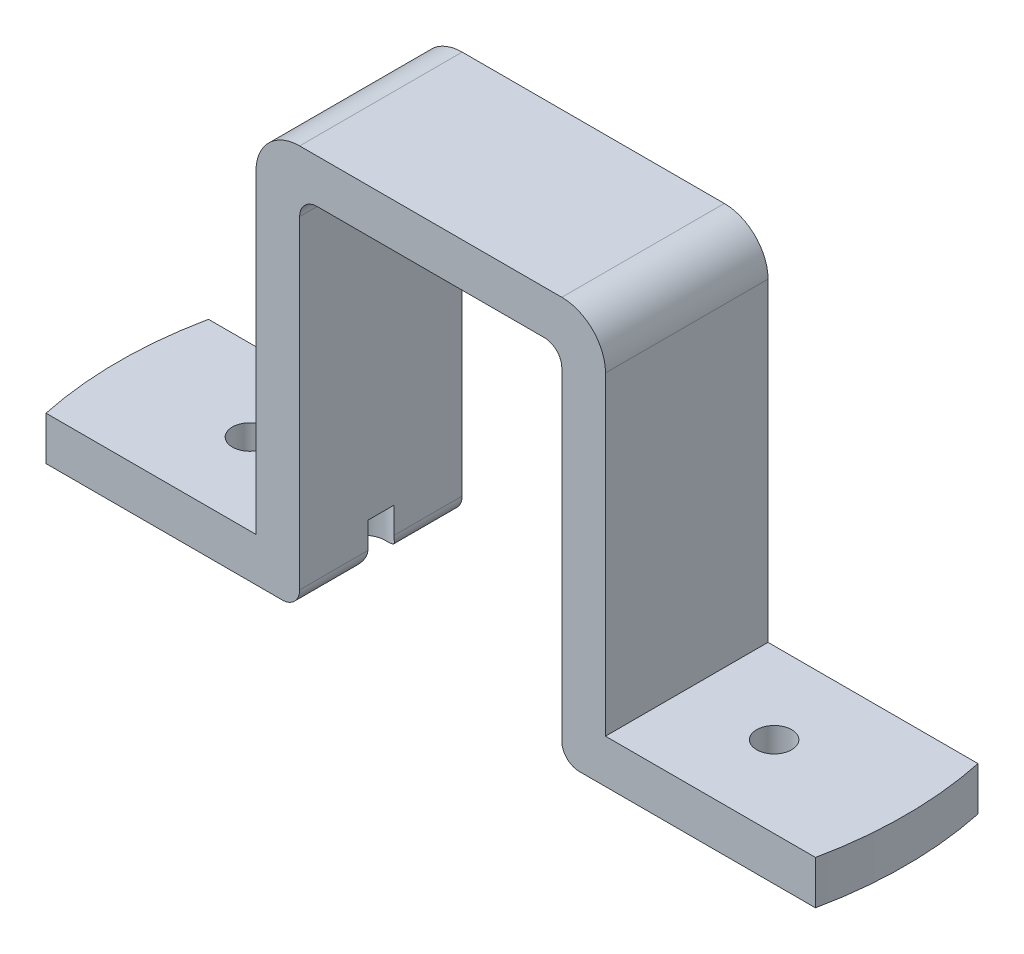
ISO-10303-21;
HEADER;
FILE_DESCRIPTION(('STEP AP214'),'2;1');
FILE_NAME('part.step','',(''),(''),'','','');
FILE_SCHEMA(('AUTOMOTIVE_DESIGN { 1 0 10303 214 1 1 1 1 }'));
ENDSEC;
DATA;
#1=APPLICATION_CONTEXT('core data for automotive mechanical design processes');
#2=APPLICATION_PROTOCOL_DEFINITION('international standard','automotive_design',2000,#1);
#3=PRODUCT_CONTEXT('',#1,'mechanical');
#4=PRODUCT('Part','Part','',(#3));
#5=PRODUCT_RELATED_PRODUCT_CATEGORY('part','',(#4));
#6=PRODUCT_DEFINITION_FORMATION('','',#4);
#7=PRODUCT_DEFINITION_CONTEXT('part definition',#1,'design');
#8=PRODUCT_DEFINITION('design','',#6,#7);
#9=PRODUCT_DEFINITION_SHAPE('','',#8);
#10=(LENGTH_UNIT() NAMED_UNIT(*) SI_UNIT(.MILLI.,.METRE.));
#11=(NAMED_UNIT(*) PLANE_ANGLE_UNIT() SI_UNIT($,.RADIAN.));
#12=(NAMED_UNIT(*) SI_UNIT($,.STERADIAN.) SOLID_ANGLE_UNIT());
#13=UNCERTAINTY_MEASURE_WITH_UNIT(LENGTH_MEASURE(1.E-05),#10,'distance_accuracy_value','');
#14=(GEOMETRIC_REPRESENTATION_CONTEXT(3) GLOBAL_UNCERTAINTY_ASSIGNED_CONTEXT((#13)) GLOBAL_UNIT_ASSIGNED_CONTEXT((#10,
#11,#12)) REPRESENTATION_CONTEXT('',''));
#15=CARTESIAN_POINT('',(0.,0.,0.));
#16=DIRECTION('',(0.,0.,1.));
#17=DIRECTION('',(1.,0.,0.));
#18=AXIS2_PLACEMENT_3D('',#15,#16,#17);
#19=CARTESIAN_POINT('',(0.,5.,18.6));
#20=DIRECTION('',(0.,1.,0.));
#21=DIRECTION('',(0.,0.,1.));
#22=AXIS2_PLACEMENT_3D('',#19,#20,#21);
#23=PLANE('',#22);
#24=CARTESIAN_POINT('',(75.,5.,9.3));
#25=DIRECTION('',(0.,1.,0.));
#26=DIRECTION('',(0.,0.,1.));
#27=AXIS2_PLACEMENT_3D('',#24,#25,#26);
#28=CIRCLE('',#27,2.);
#29=CARTESIAN_POINT('',(75.,5.,11.3));
#30=VERTEX_POINT('',#29);
#31=EDGE_CURVE('E252',#30,#30,#28,.T.);
#32=ORIENTED_EDGE('',*,*,#31,.F.);
#33=EDGE_LOOP('',(#32));
#34=FACE_BOUND('',#33,.T.);
#35=DIRECTION('',(1.,0.,0.));
#36=VECTOR('',#35,1.);
#37=CARTESIAN_POINT('',(0.,5.,18.6));
#38=LINE('',#37,#36);
#39=CARTESIAN_POINT('',(65.,5.,18.6));
#40=VERTEX_POINT('',#39);
#41=CARTESIAN_POINT('',(89.0285134884202,5.,18.6));
#42=VERTEX_POINT('',#41);
#43=EDGE_CURVE('E239',#40,#42,#38,.T.);
#44=ORIENTED_EDGE('',*,*,#43,.T.);
#45=CARTESIAN_POINT('',(45.,5.,9.3));
#46=DIRECTION('',(0.,1.,0.));
#47=DIRECTION('',(0.,0.,1.));
#48=AXIS2_PLACEMENT_3D('',#45,#46,#47);
#49=CIRCLE('',#48,45.);
#50=CARTESIAN_POINT('',(89.0285134884202,5.,0.));
#51=VERTEX_POINT('',#50);
#52=EDGE_CURVE('E469',#42,#51,#49,.T.);
#53=ORIENTED_EDGE('',*,*,#52,.T.);
#54=DIRECTION('',(1.,0.,0.));
#55=VECTOR('',#54,1.);
#56=CARTESIAN_POINT('',(0.,5.,0.));
#57=LINE('',#56,#55);
#58=CARTESIAN_POINT('',(65.,5.,0.));
#59=VERTEX_POINT('',#58);
#60=EDGE_CURVE('E251',#59,#51,#57,.T.);
#61=ORIENTED_EDGE('',*,*,#60,.F.);
#62=DIRECTION('',(0.,0.,-1.));
#63=VECTOR('',#62,1.);
#64=CARTESIAN_POINT('',(65.,5.,18.6));
#65=LINE('',#64,#63);
#66=EDGE_CURVE('E243',#40,#59,#65,.T.);
#67=ORIENTED_EDGE('',*,*,#66,.F.);
#68=EDGE_LOOP('',(#44,#53,#61,#67));
#69=FACE_BOUND('',#68,.T.);
#70=ADVANCED_FACE('F35',(#34,#69),#23,.T.);
#71=CARTESIAN_POINT('',(0.,5.,18.6));
#72=DIRECTION('',(0.,1.,0.));
#73=DIRECTION('',(0.,0.,1.));
#74=AXIS2_PLACEMENT_3D('',#71,#72,#73);
#75=PLANE('',#74);
#76=CARTESIAN_POINT('',(15.,5.,9.3));
#77=DIRECTION('',(0.,1.,0.));
#78=DIRECTION('',(0.,0.,1.));
#79=AXIS2_PLACEMENT_3D('',#76,#77,#78);
#80=CIRCLE('',#79,2.00000000000001);
#81=CARTESIAN_POINT('',(15.,5.,11.3));
#82=VERTEX_POINT('',#81);
#83=EDGE_CURVE('E475',#82,#82,#80,.T.);
#84=ORIENTED_EDGE('',*,*,#83,.F.);
#85=EDGE_LOOP('',(#84));
#86=FACE_BOUND('',#85,.T.);
#87=DIRECTION('',(1.,0.,0.));
#88=VECTOR('',#87,1.);
#89=CARTESIAN_POINT('',(0.,5.,0.));
#90=LINE('',#89,#88);
#91=CARTESIAN_POINT('',(0.971486511579786,5.,0.));
#92=VERTEX_POINT('',#91);
#93=CARTESIAN_POINT('',(25.,5.,0.));
#94=VERTEX_POINT('',#93);
#95=EDGE_CURVE('E225',#92,#94,#90,.T.);
#96=ORIENTED_EDGE('',*,*,#95,.F.);
#97=CARTESIAN_POINT('',(45.,5.,9.3));
#98=DIRECTION('',(0.,1.,0.));
#99=DIRECTION('',(0.,0.,1.));
#100=AXIS2_PLACEMENT_3D('',#97,#98,#99);
#101=CIRCLE('',#100,45.);
#102=CARTESIAN_POINT('',(0.971486511579786,5.,18.6));
#103=VERTEX_POINT('',#102);
#104=EDGE_CURVE('E205',#92,#103,#101,.T.);
#105=ORIENTED_EDGE('',*,*,#104,.T.);
#106=DIRECTION('',(1.,0.,0.));
#107=VECTOR('',#106,1.);
#108=CARTESIAN_POINT('',(0.,5.,18.6));
#109=LINE('',#108,#107);
#110=CARTESIAN_POINT('',(25.,5.,18.6));
#111=VERTEX_POINT('',#110);
#112=EDGE_CURVE('E433',#103,#111,#109,.T.);
#113=ORIENTED_EDGE('',*,*,#112,.T.);
#114=DIRECTION('',(0.,0.,-1.));
#115=VECTOR('',#114,1.);
#116=CARTESIAN_POINT('',(25.,5.,18.6));
#117=LINE('',#116,#115);
#118=EDGE_CURVE('E240',#111,#94,#117,.T.);
#119=ORIENTED_EDGE('',*,*,#118,.T.);
#120=EDGE_LOOP('',(#96,#105,#113,#119));
#121=FACE_BOUND('',#120,.T.);
#122=ADVANCED_FACE('F388',(#86,#121),#75,.T.);
#123=CARTESIAN_POINT('',(0.,0.,18.6));
#124=DIRECTION('',(0.,1.,0.));
#125=DIRECTION('',(0.,0.,1.));
#126=AXIS2_PLACEMENT_3D('',#123,#124,#125);
#127=PLANE('',#126);
#128=CARTESIAN_POINT('',(15.,0.,9.3));
#129=DIRECTION('',(0.,1.,0.));
#130=DIRECTION('',(0.,0.,1.));
#131=AXIS2_PLACEMENT_3D('',#128,#129,#130);
#132=CIRCLE('',#131,2.00000000000001);
#133=CARTESIAN_POINT('',(15.,0.,11.3));
#134=VERTEX_POINT('',#133);
#135=EDGE_CURVE('E264',#134,#134,#132,.T.);
#136=ORIENTED_EDGE('',*,*,#135,.T.);
#137=EDGE_LOOP('',(#136));
#138=FACE_BOUND('',#137,.T.);
#139=DIRECTION('',(1.,0.,0.));
#140=VECTOR('',#139,1.);
#141=CARTESIAN_POINT('',(0.,0.,0.));
#142=LINE('',#141,#140);
#143=CARTESIAN_POINT('',(0.971486511579786,0.,0.));
#144=VERTEX_POINT('',#143);
#145=CARTESIAN_POINT('',(28.,0.,0.));
#146=VERTEX_POINT('',#145);
#147=EDGE_CURVE('E216',#144,#146,#142,.T.);
#148=ORIENTED_EDGE('',*,*,#147,.T.);
#149=DIRECTION('',(0.,0.,-1.));
#150=VECTOR('',#149,1.);
#151=CARTESIAN_POINT('',(28.,0.,18.6));
#152=LINE('',#151,#150);
#153=CARTESIAN_POINT('',(28.,0.,6.8));
#154=VERTEX_POINT('',#153);
#155=EDGE_CURVE('E326',#146,#154,#152,.F.);
#156=ORIENTED_EDGE('',*,*,#155,.T.);
#157=CARTESIAN_POINT('',(28.,0.,9.3));
#158=DIRECTION('',(0.,1.,0.));
#159=DIRECTION('',(0.,0.,1.));
#160=AXIS2_PLACEMENT_3D('',#157,#158,#159);
#161=CIRCLE('',#160,2.5);
#162=CARTESIAN_POINT('',(28.,0.,11.8));
#163=VERTEX_POINT('',#162);
#164=EDGE_CURVE('E266',#154,#163,#161,.T.);
#165=ORIENTED_EDGE('',*,*,#164,.T.);
#166=DIRECTION('',(0.,0.,-1.));
#167=VECTOR('',#166,1.);
#168=CARTESIAN_POINT('',(28.,0.,18.6));
#169=LINE('',#168,#167);
#170=CARTESIAN_POINT('',(28.,0.,18.6));
#171=VERTEX_POINT('',#170);
#172=EDGE_CURVE('E301',#163,#171,#169,.F.);
#173=ORIENTED_EDGE('',*,*,#172,.T.);
#174=DIRECTION('',(1.,0.,0.));
#175=VECTOR('',#174,1.);
#176=CARTESIAN_POINT('',(0.,0.,18.6));
#177=LINE('',#176,#175);
#178=CARTESIAN_POINT('',(0.971486511579786,0.,18.6));
#179=VERTEX_POINT('',#178);
#180=EDGE_CURVE('E219',#179,#171,#177,.T.);
#181=ORIENTED_EDGE('',*,*,#180,.F.);
#182=CARTESIAN_POINT('',(45.,0.,9.3));
#183=DIRECTION('',(0.,1.,0.));
#184=DIRECTION('',(0.,0.,1.));
#185=AXIS2_PLACEMENT_3D('',#182,#183,#184);
#186=CIRCLE('',#185,45.);
#187=EDGE_CURVE('E202',#144,#179,#186,.T.);
#188=ORIENTED_EDGE('',*,*,#187,.F.);
#189=EDGE_LOOP('',(#148,#156,#165,#173,#181,#188));
#190=FACE_BOUND('',#189,.T.);
#191=ADVANCED_FACE('F215',(#138,#190),#127,.F.);
#192=CARTESIAN_POINT('',(0.,0.,18.6));
#193=DIRECTION('',(0.,1.,0.));
#194=DIRECTION('',(0.,0.,1.));
#195=AXIS2_PLACEMENT_3D('',#192,#193,#194);
#196=PLANE('',#195);
#197=CARTESIAN_POINT('',(75.,0.,9.3));
#198=DIRECTION('',(0.,1.,0.));
#199=DIRECTION('',(0.,0.,1.));
#200=AXIS2_PLACEMENT_3D('',#197,#198,#199);
#201=CIRCLE('',#200,2.);
#202=CARTESIAN_POINT('',(75.,0.,11.3));
#203=VERTEX_POINT('',#202);
#204=EDGE_CURVE('E248',#203,#203,#201,.T.);
#205=ORIENTED_EDGE('',*,*,#204,.T.);
#206=EDGE_LOOP('',(#205));
#207=FACE_BOUND('',#206,.T.);
#208=CARTESIAN_POINT('',(62.,0.,9.3));
#209=DIRECTION('',(0.,1.,0.));
#210=DIRECTION('',(0.,0.,1.));
#211=AXIS2_PLACEMENT_3D('',#208,#209,#210);
#212=CIRCLE('',#211,2.5);
#213=CARTESIAN_POINT('',(62.,0.,11.8));
#214=VERTEX_POINT('',#213);
#215=CARTESIAN_POINT('',(62.,0.,6.80000000000001));
#216=VERTEX_POINT('',#215);
#217=EDGE_CURVE('E247',#214,#216,#212,.T.);
#218=ORIENTED_EDGE('',*,*,#217,.T.);
#219=DIRECTION('',(0.,0.,-1.));
#220=VECTOR('',#219,1.);
#221=CARTESIAN_POINT('',(62.,0.,18.6));
#222=LINE('',#221,#220);
#223=CARTESIAN_POINT('',(62.,0.,0.));
#224=VERTEX_POINT('',#223);
#225=EDGE_CURVE('E325',#216,#224,#222,.T.);
#226=ORIENTED_EDGE('',*,*,#225,.T.);
#227=DIRECTION('',(1.,0.,0.));
#228=VECTOR('',#227,1.);
#229=CARTESIAN_POINT('',(0.,0.,0.));
#230=LINE('',#229,#228);
#231=CARTESIAN_POINT('',(89.0285134884202,0.,0.));
#232=VERTEX_POINT('',#231);
#233=EDGE_CURVE('E237',#224,#232,#230,.T.);
#234=ORIENTED_EDGE('',*,*,#233,.T.);
#235=CARTESIAN_POINT('',(45.,0.,9.3));
#236=DIRECTION('',(0.,1.,0.));
#237=DIRECTION('',(0.,0.,1.));
#238=AXIS2_PLACEMENT_3D('',#235,#236,#237);
#239=CIRCLE('',#238,45.);
#240=CARTESIAN_POINT('',(89.0285134884202,0.,18.6));
#241=VERTEX_POINT('',#240);
#242=EDGE_CURVE('E464',#241,#232,#239,.T.);
#243=ORIENTED_EDGE('',*,*,#242,.F.);
#244=DIRECTION('',(1.,0.,0.));
#245=VECTOR('',#244,1.);
#246=CARTESIAN_POINT('',(0.,0.,18.6));
#247=LINE('',#246,#245);
#248=CARTESIAN_POINT('',(62.,0.,18.6));
#249=VERTEX_POINT('',#248);
#250=EDGE_CURVE('E244',#249,#241,#247,.T.);
#251=ORIENTED_EDGE('',*,*,#250,.F.);
#252=DIRECTION('',(0.,0.,-1.));
#253=VECTOR('',#252,1.);
#254=CARTESIAN_POINT('',(62.,0.,18.6));
#255=LINE('',#254,#253);
#256=EDGE_CURVE('E352',#249,#214,#255,.T.);
#257=ORIENTED_EDGE('',*,*,#256,.T.);
#258=EDGE_LOOP('',(#218,#226,#234,#243,#251,#257));
#259=FACE_BOUND('',#258,.T.);
#260=ADVANCED_FACE('F367',(#207,#259),#196,.F.);
#261=CARTESIAN_POINT('',(0.,0.,18.6));
#262=DIRECTION('',(0.,0.,1.));
#263=DIRECTION('',(1.,0.,0.));
#264=AXIS2_PLACEMENT_3D('',#261,#262,#263);
#265=PLANE('',#264);
#266=ORIENTED_EDGE('',*,*,#180,.T.);
#267=CARTESIAN_POINT('',(28.,2.,18.6));
#268=DIRECTION('',(0.,0.,1.));
#269=DIRECTION('',(1.,0.,0.));
#270=AXIS2_PLACEMENT_3D('',#267,#268,#269);
#271=CIRCLE('',#270,2.);
#272=CARTESIAN_POINT('',(30.,2.,18.6));
#273=VERTEX_POINT('',#272);
#274=EDGE_CURVE('E717',#171,#273,#271,.T.);
#275=ORIENTED_EDGE('',*,*,#274,.T.);
#276=DIRECTION('',(0.,1.,0.));
#277=VECTOR('',#276,1.);
#278=CARTESIAN_POINT('',(30.,0.,18.6));
#279=LINE('',#278,#277);
#280=CARTESIAN_POINT('',(30.,39.,18.6));
#281=VERTEX_POINT('',#280);
#282=EDGE_CURVE('E440',#273,#281,#279,.T.);
#283=ORIENTED_EDGE('',*,*,#282,.T.);
#284=CARTESIAN_POINT('',(32.,39.,18.6));
#285=DIRECTION('',(0.,0.,1.));
#286=DIRECTION('',(1.,0.,0.));
#287=AXIS2_PLACEMENT_3D('',#284,#285,#286);
#288=CIRCLE('',#287,2.);
#289=CARTESIAN_POINT('',(32.,41.,18.6));
#290=VERTEX_POINT('',#289);
#291=EDGE_CURVE('E700',#281,#290,#288,.F.);
#292=ORIENTED_EDGE('',*,*,#291,.T.);
#293=DIRECTION('',(1.,0.,0.));
#294=VECTOR('',#293,1.);
#295=CARTESIAN_POINT('',(0.,41.,18.6));
#296=LINE('',#295,#294);
#297=CARTESIAN_POINT('',(58.,41.,18.6));
#298=VERTEX_POINT('',#297);
#299=EDGE_CURVE('E443',#290,#298,#296,.T.);
#300=ORIENTED_EDGE('',*,*,#299,.T.);
#301=CARTESIAN_POINT('',(58.,39.,18.6));
#302=DIRECTION('',(0.,0.,1.));
#303=DIRECTION('',(1.,0.,0.));
#304=AXIS2_PLACEMENT_3D('',#301,#302,#303);
#305=CIRCLE('',#304,2.);
#306=CARTESIAN_POINT('',(60.,39.,18.6));
#307=VERTEX_POINT('',#306);
#308=EDGE_CURVE('E695',#298,#307,#305,.F.);
#309=ORIENTED_EDGE('',*,*,#308,.T.);
#310=DIRECTION('',(0.,-1.,0.));
#311=VECTOR('',#310,1.);
#312=CARTESIAN_POINT('',(60.,0.,18.6));
#313=LINE('',#312,#311);
#314=CARTESIAN_POINT('',(60.,2.,18.6));
#315=VERTEX_POINT('',#314);
#316=EDGE_CURVE('E446',#307,#315,#313,.T.);
#317=ORIENTED_EDGE('',*,*,#316,.T.);
#318=CARTESIAN_POINT('',(62.,2.,18.6));
#319=DIRECTION('',(0.,0.,1.));
#320=DIRECTION('',(1.,0.,0.));
#321=AXIS2_PLACEMENT_3D('',#318,#319,#320);
#322=CIRCLE('',#321,2.);
#323=EDGE_CURVE('E686',#315,#249,#322,.T.);
#324=ORIENTED_EDGE('',*,*,#323,.T.);
#325=ORIENTED_EDGE('',*,*,#250,.T.);
#326=DIRECTION('',(0.,1.,0.));
#327=VECTOR('',#326,1.);
#328=CARTESIAN_POINT('',(89.0285134884202,-14.,18.6));
#329=LINE('',#328,#327);
#330=EDGE_CURVE('E471',#241,#42,#329,.T.);
#331=ORIENTED_EDGE('',*,*,#330,.T.);
#332=ORIENTED_EDGE('',*,*,#43,.F.);
#333=DIRECTION('',(0.,-1.,0.));
#334=VECTOR('',#333,1.);
#335=CARTESIAN_POINT('',(65.,0.,18.6));
#336=LINE('',#335,#334);
#337=CARTESIAN_POINT('',(65.,41.,18.6));
#338=VERTEX_POINT('',#337);
#339=EDGE_CURVE('E426',#338,#40,#336,.T.);
#340=ORIENTED_EDGE('',*,*,#339,.F.);
#341=CARTESIAN_POINT('',(60.,41.,18.6));
#342=DIRECTION('',(0.,0.,1.));
#343=DIRECTION('',(1.,0.,0.));
#344=AXIS2_PLACEMENT_3D('',#341,#342,#343);
#345=CIRCLE('',#344,5.);
#346=CARTESIAN_POINT('',(60.,46.,18.6));
#347=VERTEX_POINT('',#346);
#348=EDGE_CURVE('E286',#338,#347,#345,.T.);
#349=ORIENTED_EDGE('',*,*,#348,.T.);
#350=DIRECTION('',(1.,0.,0.));
#351=VECTOR('',#350,1.);
#352=CARTESIAN_POINT('',(0.,46.,18.6));
#353=LINE('',#352,#351);
#354=CARTESIAN_POINT('',(30.,46.,18.6));
#355=VERTEX_POINT('',#354);
#356=EDGE_CURVE('E423',#355,#347,#353,.T.);
#357=ORIENTED_EDGE('',*,*,#356,.F.);
#358=CARTESIAN_POINT('',(30.,41.,18.6));
#359=DIRECTION('',(0.,0.,1.));
#360=DIRECTION('',(1.,0.,0.));
#361=AXIS2_PLACEMENT_3D('',#358,#359,#360);
#362=CIRCLE('',#361,5.);
#363=CARTESIAN_POINT('',(25.,41.,18.6));
#364=VERTEX_POINT('',#363);
#365=EDGE_CURVE('E277',#355,#364,#362,.T.);
#366=ORIENTED_EDGE('',*,*,#365,.T.);
#367=DIRECTION('',(0.,1.,0.));
#368=VECTOR('',#367,1.);
#369=CARTESIAN_POINT('',(25.,0.,18.6));
#370=LINE('',#369,#368);
#371=EDGE_CURVE('E430',#111,#364,#370,.T.);
#372=ORIENTED_EDGE('',*,*,#371,.F.);
#373=ORIENTED_EDGE('',*,*,#112,.F.);
#374=DIRECTION('',(0.,1.,0.));
#375=VECTOR('',#374,1.);
#376=CARTESIAN_POINT('',(0.971486511579786,-14.,18.6));
#377=LINE('',#376,#375);
#378=EDGE_CURVE('E461',#103,#179,#377,.F.);
#379=ORIENTED_EDGE('',*,*,#378,.T.);
#380=EDGE_LOOP('',(#266,#275,#283,#292,#300,#309,#317,#324,#325,#331,#332,#340,#349,#357,#366,
#372,#373,#379));
#381=FACE_BOUND('',#380,.T.);
#382=ADVANCED_FACE('F364',(#381),#265,.T.);
#383=CARTESIAN_POINT('',(0.,0.,0.));
#384=DIRECTION('',(0.,0.,1.));
#385=DIRECTION('',(1.,0.,0.));
#386=AXIS2_PLACEMENT_3D('',#383,#384,#385);
#387=PLANE('',#386);
#388=DIRECTION('',(0.,1.,0.));
#389=VECTOR('',#388,1.);
#390=CARTESIAN_POINT('',(30.,0.,0.));
#391=LINE('',#390,#389);
#392=CARTESIAN_POINT('',(30.,2.,0.));
#393=VERTEX_POINT('',#392);
#394=CARTESIAN_POINT('',(30.,39.,0.));
#395=VERTEX_POINT('',#394);
#396=EDGE_CURVE('E224',#393,#395,#391,.T.);
#397=ORIENTED_EDGE('',*,*,#396,.F.);
#398=CARTESIAN_POINT('',(28.,2.,0.));
#399=DIRECTION('',(0.,0.,1.));
#400=DIRECTION('',(1.,0.,0.));
#401=AXIS2_PLACEMENT_3D('',#398,#399,#400);
#402=CIRCLE('',#401,2.);
#403=EDGE_CURVE('E223',#393,#146,#402,.F.);
#404=ORIENTED_EDGE('',*,*,#403,.T.);
#405=ORIENTED_EDGE('',*,*,#147,.F.);
#406=DIRECTION('',(0.,1.,0.));
#407=VECTOR('',#406,1.);
#408=CARTESIAN_POINT('',(0.971486511579786,-14.,0.));
#409=LINE('',#408,#407);
#410=EDGE_CURVE('E199',#92,#144,#409,.F.);
#411=ORIENTED_EDGE('',*,*,#410,.F.);
#412=ORIENTED_EDGE('',*,*,#95,.T.);
#413=DIRECTION('',(0.,1.,0.));
#414=VECTOR('',#413,1.);
#415=CARTESIAN_POINT('',(25.,0.,0.));
#416=LINE('',#415,#414);
#417=CARTESIAN_POINT('',(25.,41.,0.));
#418=VERTEX_POINT('',#417);
#419=EDGE_CURVE('E229',#94,#418,#416,.T.);
#420=ORIENTED_EDGE('',*,*,#419,.T.);
#421=CARTESIAN_POINT('',(30.,41.,0.));
#422=DIRECTION('',(0.,0.,1.));
#423=DIRECTION('',(1.,0.,0.));
#424=AXIS2_PLACEMENT_3D('',#421,#422,#423);
#425=CIRCLE('',#424,5.);
#426=CARTESIAN_POINT('',(30.,46.,0.));
#427=VERTEX_POINT('',#426);
#428=EDGE_CURVE('E273',#418,#427,#425,.F.);
#429=ORIENTED_EDGE('',*,*,#428,.T.);
#430=DIRECTION('',(1.,0.,0.));
#431=VECTOR('',#430,1.);
#432=CARTESIAN_POINT('',(0.,46.,0.));
#433=LINE('',#432,#431);
#434=CARTESIAN_POINT('',(60.,46.,0.));
#435=VERTEX_POINT('',#434);
#436=EDGE_CURVE('E454',#427,#435,#433,.T.);
#437=ORIENTED_EDGE('',*,*,#436,.T.);
#438=CARTESIAN_POINT('',(60.,41.,0.));
#439=DIRECTION('',(0.,0.,1.));
#440=DIRECTION('',(1.,0.,0.));
#441=AXIS2_PLACEMENT_3D('',#438,#439,#440);
#442=CIRCLE('',#441,5.);
#443=CARTESIAN_POINT('',(65.,41.,0.));
#444=VERTEX_POINT('',#443);
#445=EDGE_CURVE('E282',#435,#444,#442,.F.);
#446=ORIENTED_EDGE('',*,*,#445,.T.);
#447=DIRECTION('',(0.,-1.,0.));
#448=VECTOR('',#447,1.);
#449=CARTESIAN_POINT('',(65.,0.,0.));
#450=LINE('',#449,#448);
#451=EDGE_CURVE('E452',#444,#59,#450,.T.);
#452=ORIENTED_EDGE('',*,*,#451,.T.);
#453=ORIENTED_EDGE('',*,*,#60,.T.);
#454=DIRECTION('',(0.,1.,0.));
#455=VECTOR('',#454,1.);
#456=CARTESIAN_POINT('',(89.0285134884202,-14.,0.));
#457=LINE('',#456,#455);
#458=EDGE_CURVE('E209',#232,#51,#457,.T.);
#459=ORIENTED_EDGE('',*,*,#458,.F.);
#460=ORIENTED_EDGE('',*,*,#233,.F.);
#461=CARTESIAN_POINT('',(62.,2.,0.));
#462=DIRECTION('',(0.,0.,1.));
#463=DIRECTION('',(1.,0.,0.));
#464=AXIS2_PLACEMENT_3D('',#461,#462,#463);
#465=CIRCLE('',#464,2.);
#466=CARTESIAN_POINT('',(60.,2.,0.));
#467=VERTEX_POINT('',#466);
#468=EDGE_CURVE('E506',#224,#467,#465,.F.);
#469=ORIENTED_EDGE('',*,*,#468,.T.);
#470=DIRECTION('',(0.,-1.,0.));
#471=VECTOR('',#470,1.);
#472=CARTESIAN_POINT('',(60.,0.,0.));
#473=LINE('',#472,#471);
#474=CARTESIAN_POINT('',(60.,39.,0.));
#475=VERTEX_POINT('',#474);
#476=EDGE_CURVE('E235',#475,#467,#473,.T.);
#477=ORIENTED_EDGE('',*,*,#476,.F.);
#478=CARTESIAN_POINT('',(58.,39.,0.));
#479=DIRECTION('',(0.,0.,1.));
#480=DIRECTION('',(1.,0.,0.));
#481=AXIS2_PLACEMENT_3D('',#478,#479,#480);
#482=CIRCLE('',#481,2.);
#483=CARTESIAN_POINT('',(58.,41.,0.));
#484=VERTEX_POINT('',#483);
#485=EDGE_CURVE('E693',#475,#484,#482,.T.);
#486=ORIENTED_EDGE('',*,*,#485,.T.);
#487=DIRECTION('',(1.,0.,0.));
#488=VECTOR('',#487,1.);
#489=CARTESIAN_POINT('',(0.,41.,0.));
#490=LINE('',#489,#488);
#491=CARTESIAN_POINT('',(32.,41.,0.));
#492=VERTEX_POINT('',#491);
#493=EDGE_CURVE('E227',#492,#484,#490,.T.);
#494=ORIENTED_EDGE('',*,*,#493,.F.);
#495=CARTESIAN_POINT('',(32.,39.,0.));
#496=DIRECTION('',(0.,0.,1.));
#497=DIRECTION('',(1.,0.,0.));
#498=AXIS2_PLACEMENT_3D('',#495,#496,#497);
#499=CIRCLE('',#498,2.);
#500=EDGE_CURVE('E697',#492,#395,#499,.T.);
#501=ORIENTED_EDGE('',*,*,#500,.T.);
#502=EDGE_LOOP('',(#397,#404,#405,#411,#412,#420,#429,#437,#446,#452,#453,#459,#460,#469,#477,
#486,#494,#501));
#503=FACE_BOUND('',#502,.T.);
#504=ADVANCED_FACE('F222',(#503),#387,.F.);
#505=CARTESIAN_POINT('',(65.,0.,18.6));
#506=DIRECTION('',(1.,0.,0.));
#507=DIRECTION('',(0.,0.,-1.));
#508=AXIS2_PLACEMENT_3D('',#505,#506,#507);
#509=PLANE('',#508);
#510=ORIENTED_EDGE('',*,*,#451,.F.);
#511=DIRECTION('',(0.,0.,-1.));
#512=VECTOR('',#511,1.);
#513=CARTESIAN_POINT('',(65.,41.,18.6));
#514=LINE('',#513,#512);
#515=EDGE_CURVE('E284',#444,#338,#514,.F.);
#516=ORIENTED_EDGE('',*,*,#515,.T.);
#517=ORIENTED_EDGE('',*,*,#339,.T.);
#518=ORIENTED_EDGE('',*,*,#66,.T.);
#519=EDGE_LOOP('',(#510,#516,#517,#518));
#520=FACE_BOUND('',#519,.T.);
#521=ADVANCED_FACE('F371',(#520),#509,.T.);
#522=CARTESIAN_POINT('',(0.,46.,18.6));
#523=DIRECTION('',(0.,1.,0.));
#524=DIRECTION('',(0.,0.,1.));
#525=AXIS2_PLACEMENT_3D('',#522,#523,#524);
#526=PLANE('',#525);
#527=ORIENTED_EDGE('',*,*,#356,.T.);
#528=DIRECTION('',(0.,0.,-1.));
#529=VECTOR('',#528,1.);
#530=CARTESIAN_POINT('',(60.,46.,18.6));
#531=LINE('',#530,#529);
#532=EDGE_CURVE('E279',#347,#435,#531,.T.);
#533=ORIENTED_EDGE('',*,*,#532,.T.);
#534=ORIENTED_EDGE('',*,*,#436,.F.);
#535=DIRECTION('',(0.,0.,-1.));
#536=VECTOR('',#535,1.);
#537=CARTESIAN_POINT('',(30.,46.,18.6));
#538=LINE('',#537,#536);
#539=EDGE_CURVE('E275',#427,#355,#538,.F.);
#540=ORIENTED_EDGE('',*,*,#539,.T.);
#541=EDGE_LOOP('',(#527,#533,#534,#540));
#542=FACE_BOUND('',#541,.T.);
#543=ADVANCED_FACE('F395',(#542),#526,.T.);
#544=CARTESIAN_POINT('',(25.,0.,18.6));
#545=DIRECTION('',(-1.,0.,0.));
#546=DIRECTION('',(0.,0.,1.));
#547=AXIS2_PLACEMENT_3D('',#544,#545,#546);
#548=PLANE('',#547);
#549=ORIENTED_EDGE('',*,*,#371,.T.);
#550=DIRECTION('',(0.,0.,-1.));
#551=VECTOR('',#550,1.);
#552=CARTESIAN_POINT('',(25.,41.,18.6));
#553=LINE('',#552,#551);
#554=EDGE_CURVE('E270',#364,#418,#553,.T.);
#555=ORIENTED_EDGE('',*,*,#554,.T.);
#556=ORIENTED_EDGE('',*,*,#419,.F.);
#557=ORIENTED_EDGE('',*,*,#118,.F.);
#558=EDGE_LOOP('',(#549,#555,#556,#557));
#559=FACE_BOUND('',#558,.T.);
#560=ADVANCED_FACE('F384',(#559),#548,.T.);
#561=CARTESIAN_POINT('',(30.,0.,18.6));
#562=DIRECTION('',(-1.,0.,0.));
#563=DIRECTION('',(0.,0.,1.));
#564=AXIS2_PLACEMENT_3D('',#561,#562,#563);
#565=PLANE('',#564);
#566=DIRECTION('',(0.,1.,0.));
#567=VECTOR('',#566,1.);
#568=CARTESIAN_POINT('',(30.,-5.,7.80000000000001));
#569=LINE('',#568,#567);
#570=CARTESIAN_POINT('',(30.,5.,7.80000000000001));
#571=VERTEX_POINT('',#570);
#572=CARTESIAN_POINT('',(30.,2.,7.80000000000001));
#573=VERTEX_POINT('',#572);
#574=EDGE_CURVE('E260',#571,#573,#569,.F.);
#575=ORIENTED_EDGE('',*,*,#574,.T.);
#576=DIRECTION('',(0.,0.,-1.));
#577=VECTOR('',#576,1.);
#578=CARTESIAN_POINT('',(30.,2.,18.6));
#579=LINE('',#578,#577);
#580=EDGE_CURVE('E509',#573,#393,#579,.T.);
#581=ORIENTED_EDGE('',*,*,#580,.T.);
#582=ORIENTED_EDGE('',*,*,#396,.T.);
#583=DIRECTION('',(0.,0.,-1.));
#584=VECTOR('',#583,1.);
#585=CARTESIAN_POINT('',(30.,39.,18.6));
#586=LINE('',#585,#584);
#587=EDGE_CURVE('E288',#395,#281,#586,.F.);
#588=ORIENTED_EDGE('',*,*,#587,.T.);
#589=ORIENTED_EDGE('',*,*,#282,.F.);
#590=DIRECTION('',(0.,0.,-1.));
#591=VECTOR('',#590,1.);
#592=CARTESIAN_POINT('',(30.,2.,18.6));
#593=LINE('',#592,#591);
#594=CARTESIAN_POINT('',(30.,2.,10.8));
#595=VERTEX_POINT('',#594);
#596=EDGE_CURVE('E290',#273,#595,#593,.T.);
#597=ORIENTED_EDGE('',*,*,#596,.T.);
#598=DIRECTION('',(0.,1.,0.));
#599=VECTOR('',#598,1.);
#600=CARTESIAN_POINT('',(30.,-5.,10.8));
#601=LINE('',#600,#599);
#602=CARTESIAN_POINT('',(30.,5.,10.8));
#603=VERTEX_POINT('',#602);
#604=EDGE_CURVE('E210',#595,#603,#601,.T.);
#605=ORIENTED_EDGE('',*,*,#604,.T.);
#606=DIRECTION('',(0.,0.,-1.));
#607=VECTOR('',#606,1.);
#608=CARTESIAN_POINT('',(30.,5.,18.6));
#609=LINE('',#608,#607);
#610=EDGE_CURVE('E257',#603,#571,#609,.T.);
#611=ORIENTED_EDGE('',*,*,#610,.T.);
#612=EDGE_LOOP('',(#575,#581,#582,#588,#589,#597,#605,#611));
#613=FACE_BOUND('',#612,.T.);
#614=ADVANCED_FACE('F380',(#613),#565,.F.);
#615=CARTESIAN_POINT('',(0.,41.,18.6));
#616=DIRECTION('',(0.,1.,0.));
#617=DIRECTION('',(0.,0.,1.));
#618=AXIS2_PLACEMENT_3D('',#615,#616,#617);
#619=PLANE('',#618);
#620=ORIENTED_EDGE('',*,*,#493,.T.);
#621=DIRECTION('',(0.,0.,-1.));
#622=VECTOR('',#621,1.);
#623=CARTESIAN_POINT('',(58.,41.,18.6));
#624=LINE('',#623,#622);
#625=EDGE_CURVE('E689',#484,#298,#624,.F.);
#626=ORIENTED_EDGE('',*,*,#625,.T.);
#627=ORIENTED_EDGE('',*,*,#299,.F.);
#628=DIRECTION('',(0.,0.,-1.));
#629=VECTOR('',#628,1.);
#630=CARTESIAN_POINT('',(32.,41.,0.));
#631=LINE('',#630,#629);
#632=EDGE_CURVE('E687',#290,#492,#631,.T.);
#633=ORIENTED_EDGE('',*,*,#632,.T.);
#634=EDGE_LOOP('',(#620,#626,#627,#633));
#635=FACE_BOUND('',#634,.T.);
#636=ADVANCED_FACE('F377',(#635),#619,.F.);
#637=CARTESIAN_POINT('',(60.,0.,18.6));
#638=DIRECTION('',(1.,0.,0.));
#639=DIRECTION('',(0.,0.,-1.));
#640=AXIS2_PLACEMENT_3D('',#637,#638,#639);
#641=PLANE('',#640);
#642=ORIENTED_EDGE('',*,*,#476,.T.);
#643=DIRECTION('',(0.,0.,-1.));
#644=VECTOR('',#643,1.);
#645=CARTESIAN_POINT('',(60.,2.,18.6));
#646=LINE('',#645,#644);
#647=CARTESIAN_POINT('',(60.,2.,7.80000000000001));
#648=VERTEX_POINT('',#647);
#649=EDGE_CURVE('E48',#467,#648,#646,.F.);
#650=ORIENTED_EDGE('',*,*,#649,.T.);
#651=DIRECTION('',(0.,1.,0.));
#652=VECTOR('',#651,1.);
#653=CARTESIAN_POINT('',(60.,-5.,7.80000000000001));
#654=LINE('',#653,#652);
#655=CARTESIAN_POINT('',(60.,5.,7.80000000000001));
#656=VERTEX_POINT('',#655);
#657=EDGE_CURVE('E486',#648,#656,#654,.T.);
#658=ORIENTED_EDGE('',*,*,#657,.T.);
#659=DIRECTION('',(0.,0.,1.));
#660=VECTOR('',#659,1.);
#661=CARTESIAN_POINT('',(60.,5.,18.6));
#662=LINE('',#661,#660);
#663=CARTESIAN_POINT('',(60.,5.,10.8));
#664=VERTEX_POINT('',#663);
#665=EDGE_CURVE('E254',#656,#664,#662,.T.);
#666=ORIENTED_EDGE('',*,*,#665,.T.);
#667=DIRECTION('',(0.,1.,0.));
#668=VECTOR('',#667,1.);
#669=CARTESIAN_POINT('',(60.,-5.,10.8));
#670=LINE('',#669,#668);
#671=CARTESIAN_POINT('',(60.,2.,10.8));
#672=VERTEX_POINT('',#671);
#673=EDGE_CURVE('E478',#664,#672,#670,.F.);
#674=ORIENTED_EDGE('',*,*,#673,.T.);
#675=DIRECTION('',(0.,0.,-1.));
#676=VECTOR('',#675,1.);
#677=CARTESIAN_POINT('',(60.,2.,18.6));
#678=LINE('',#677,#676);
#679=EDGE_CURVE('E684',#672,#315,#678,.F.);
#680=ORIENTED_EDGE('',*,*,#679,.T.);
#681=ORIENTED_EDGE('',*,*,#316,.F.);
#682=DIRECTION('',(0.,0.,-1.));
#683=VECTOR('',#682,1.);
#684=CARTESIAN_POINT('',(60.,39.,0.));
#685=LINE('',#684,#683);
#686=EDGE_CURVE('E351',#307,#475,#685,.T.);
#687=ORIENTED_EDGE('',*,*,#686,.T.);
#688=EDGE_LOOP('',(#642,#650,#658,#666,#674,#680,#681,#687));
#689=FACE_BOUND('',#688,.T.);
#690=ADVANCED_FACE('F362',(#689),#641,.F.);
#691=CARTESIAN_POINT('',(75.,-5.,9.3));
#692=DIRECTION('',(0.,1.,0.));
#693=DIRECTION('',(0.,0.,1.));
#694=AXIS2_PLACEMENT_3D('',#691,#692,#693);
#695=CYLINDRICAL_SURFACE('',#694,2.);
#696=ORIENTED_EDGE('',*,*,#31,.T.);
#697=EDGE_LOOP('',(#696));
#698=FACE_BOUND('',#697,.T.);
#699=ORIENTED_EDGE('',*,*,#204,.F.);
#700=EDGE_LOOP('',(#699));
#701=FACE_BOUND('',#700,.T.);
#702=ADVANCED_FACE('F358',(#698,#701),#695,.F.);
#703=CARTESIAN_POINT('',(62.,5.,9.3));
#704=DIRECTION('',(0.,1.,0.));
#705=DIRECTION('',(0.,0.,1.));
#706=AXIS2_PLACEMENT_3D('',#703,#704,#705);
#707=PLANE('',#706);
#708=CARTESIAN_POINT('',(62.,5.,9.3));
#709=DIRECTION('',(0.,1.,0.));
#710=DIRECTION('',(0.,0.,1.));
#711=AXIS2_PLACEMENT_3D('',#708,#709,#710);
#712=CIRCLE('',#711,2.5);
#713=EDGE_CURVE('E474',#664,#656,#712,.T.);
#714=ORIENTED_EDGE('',*,*,#713,.F.);
#715=ORIENTED_EDGE('',*,*,#665,.F.);
#716=EDGE_LOOP('',(#714,#715));
#717=FACE_BOUND('',#716,.T.);
#718=ADVANCED_FACE('F316',(#717),#707,.F.);
#719=CARTESIAN_POINT('',(62.,-5.,9.3));
#720=DIRECTION('',(0.,1.,0.));
#721=DIRECTION('',(0.,0.,1.));
#722=AXIS2_PLACEMENT_3D('',#719,#720,#721);
#723=CYLINDRICAL_SURFACE('',#722,2.5);
#724=ORIENTED_EDGE('',*,*,#657,.F.);
#725=CARTESIAN_POINT('',(60.,2.,7.80000000000001));
#726=CARTESIAN_POINT('',(59.999993725091,1.96205236120751,7.80001928249395));
#727=CARTESIAN_POINT('',(60.0010804888872,1.92412905654234,7.79855865077159));
#728=CARTESIAN_POINT('',(60.0053768842975,1.8486765115449,7.7928507717969));
#729=CARTESIAN_POINT('',(60.0085829146039,1.81114671223763,7.78860825195515));
#730=CARTESIAN_POINT('',(60.0211736747166,1.70050237284782,7.77211277366124));
#731=CARTESIAN_POINT('',(60.0335350786758,1.6282676891477,7.75608200174432));
#732=CARTESIAN_POINT('',(60.0710649428635,1.46259037295081,7.70928440586233));
#733=CARTESIAN_POINT('',(60.0992303637306,1.37078495491734,7.67529967742626));
#734=CARTESIAN_POINT('',(60.1669566330416,1.19441845500213,7.59924688457033));
#735=CARTESIAN_POINT('',(60.2066009950572,1.10991658082095,7.55712036066559));
#736=CARTESIAN_POINT('',(60.2818315607451,0.974417183210692,7.48348568538234));
#737=CARTESIAN_POINT('',(60.3146575673618,0.921350511383226,7.45289281667292));
#738=CARTESIAN_POINT('',(60.3849330443514,0.818716331860678,7.39113888276489));
#739=CARTESIAN_POINT('',(60.4223841446162,0.769150067443457,7.35997762057938));
#740=CARTESIAN_POINT('',(60.5414152627293,0.625986390766542,7.26711839688329));
#741=CARTESIAN_POINT('',(60.6298543892162,0.537598866314639,7.20585747695822));
#742=CARTESIAN_POINT('',(60.805234297658,0.392897525362518,7.10209066900032));
#743=CARTESIAN_POINT('',(60.889031813176,0.333695934630952,7.05826851796967));
#744=CARTESIAN_POINT('',(61.0675136553793,0.227656995704598,6.9783671878113));
#745=CARTESIAN_POINT('',(61.1621854432216,0.180805608264951,6.94227922555559));
#746=CARTESIAN_POINT('',(61.3447413446732,0.10826118747094,6.8858231453306));
#747=CARTESIAN_POINT('',(61.4312588744965,0.0803747108322942,6.86385863496913));
#748=CARTESIAN_POINT('',(61.6089712248031,0.0364768345780311,6.82912170550151));
#749=CARTESIAN_POINT('',(61.7001559930713,0.0204409742008209,6.8163303537777));
#750=CARTESIAN_POINT('',(61.8267540958197,0.00721440510196114,6.80576830125725));
#751=CARTESIAN_POINT('',(61.8613227863722,0.00451121826635272,6.80360771477215));
#752=CARTESIAN_POINT('',(61.9305889274173,0.000905039903912552,6.80072423473593));
#753=CARTESIAN_POINT('',(61.9652862689951,7.70903647479079E-07,6.80000032095499));
#754=CARTESIAN_POINT('',(62.,0.,6.8));
#755=B_SPLINE_CURVE_WITH_KNOTS('',3,(#725,#726,#727,#728,#729,#730,#731,#732,#733,#734,#735,
#736,#737,#738,#739,#740,#741,#742,#743,#744,#745,#746,#747,#748,#749,#750,#751,#752,#753,#754),
.UNSPECIFIED.,.F.,.F.,(4,2,2,2,2,2,2,2,2,2,2,2,2,2,4),(0.,0.113756340878303,0.227319868799894,
0.45129956036079,0.755256328437335,1.06148258404697,1.26972757241734,1.47804615725612,
1.8934471548323,2.22693688247244,2.56004586060421,2.83944828591032,3.11827237568765,
3.222435962953,3.32652555362956),.UNSPECIFIED.);
#756=EDGE_CURVE('E11',#648,#216,#755,.T.);
#757=ORIENTED_EDGE('',*,*,#756,.T.);
#758=ORIENTED_EDGE('',*,*,#217,.F.);
#759=CARTESIAN_POINT('',(62.,0.,11.8));
#760=CARTESIAN_POINT('',(61.9517010376006,-1.06670854129264E-05,11.8000112832604));
#761=CARTESIAN_POINT('',(61.903410291113,0.001749225685939,11.7986006852952));
#762=CARTESIAN_POINT('',(61.8072717360938,0.00872760391123692,11.7930218096597));
#763=CARTESIAN_POINT('',(61.7594236481728,0.0139437319263313,11.7888554116768));
#764=CARTESIAN_POINT('',(61.6648831510978,0.0277008734141562,11.7778917549173));
#765=CARTESIAN_POINT('',(61.6181847911089,0.0362168521964242,11.7711143073435));
#766=CARTESIAN_POINT('',(61.5259222368431,0.0564250606547118,11.7550857719629));
#767=CARTESIAN_POINT('',(61.4803581828766,0.0681176811622371,11.7458343797815));
#768=CARTESIAN_POINT('',(61.3460433886045,0.107642874758626,11.7146940701471));
#769=CARTESIAN_POINT('',(61.2593535798183,0.139970390183794,11.689380468348));
#770=CARTESIAN_POINT('',(61.0932046018209,0.215041875195202,11.6314177263712));
#771=CARTESIAN_POINT('',(61.0137590532359,0.257804932641074,11.5987551526794));
#772=CARTESIAN_POINT('',(60.8368150618074,0.368633082530602,11.515754242619));
#773=CARTESIAN_POINT('',(60.7426213301726,0.440328557354017,11.4632157027858));
#774=CARTESIAN_POINT('',(60.5695568442352,0.597305137945976,11.3528978990084));
#775=CARTESIAN_POINT('',(60.4907279935379,0.682622272935284,11.2951049166879));
#776=CARTESIAN_POINT('',(60.3838512347541,0.820379799436733,11.2079389534331));
#777=CARTESIAN_POINT('',(60.3498956004364,0.868353124586954,11.1785674837665));
#778=CARTESIAN_POINT('',(60.2861312940786,0.96746459391594,11.1205790320292));
#779=CARTESIAN_POINT('',(60.2563239482982,1.01860374273248,11.0919622936146));
#780=CARTESIAN_POINT('',(60.2011070930198,1.12392345841588,11.0365225349886));
#781=CARTESIAN_POINT('',(60.1756857891009,1.17809533285954,11.0096948271525));
#782=CARTESIAN_POINT('',(60.1294240226571,1.2896558296666,10.9589527501705));
#783=CARTESIAN_POINT('',(60.1085814524915,1.34704295668225,10.9350370428684));
#784=CARTESIAN_POINT('',(60.0685741888356,1.47567827042449,10.8876771353995));
#785=CARTESIAN_POINT('',(60.0503868205891,1.54756209893515,10.8650926835133));
#786=CARTESIAN_POINT('',(60.0219891184962,1.6949620777652,10.8290580989424));
#787=CARTESIAN_POINT('',(60.0117459903139,1.77046191437609,10.8155704445067));
#788=CARTESIAN_POINT('',(60.0039242739722,1.87218514983855,10.8052202018437));
#789=CARTESIAN_POINT('',(60.0024559129807,1.89766533965054,10.8032697783354));
#790=CARTESIAN_POINT('',(60.0004933215104,1.94876000676575,10.8006585128488));
#791=CARTESIAN_POINT('',(60.0000002777291,1.97437460968492,10.7999992418642));
#792=CARTESIAN_POINT('',(60.,2.,10.8));
#793=B_SPLINE_CURVE_WITH_KNOTS('',3,(#759,#760,#761,#762,#763,#764,#765,#766,#767,#768,#769,
#770,#771,#772,#773,#774,#775,#776,#777,#778,#779,#780,#781,#782,#783,#784,#785,#786,#787,#788,
#789,#790,#791,#792),.UNSPECIFIED.,.F.,.F.,(4,2,2,2,2,2,2,2,2,2,2,2,2,2,2,2,4),(0.,
0.144830830221066,0.289562975364611,0.433217938548165,0.576890584031504,0.863281542717593,
1.15020032382968,1.53670395340973,1.92424735590809,2.12119365702959,2.31820278039652,
2.51467358137344,2.71105375432232,2.94278253312363,3.17354955235508,3.25029837042764,
3.32714051378451),.UNSPECIFIED.);
#794=EDGE_CURVE('E345',#214,#672,#793,.T.);
#795=ORIENTED_EDGE('',*,*,#794,.T.);
#796=ORIENTED_EDGE('',*,*,#673,.F.);
#797=ORIENTED_EDGE('',*,*,#713,.T.);
#798=EDGE_LOOP('',(#724,#757,#758,#795,#796,#797));
#799=FACE_BOUND('',#798,.T.);
#800=ADVANCED_FACE('F313',(#799),#723,.F.);
#801=CARTESIAN_POINT('',(28.,-5.,9.3));
#802=DIRECTION('',(0.,1.,0.));
#803=DIRECTION('',(0.,0.,1.));
#804=AXIS2_PLACEMENT_3D('',#801,#802,#803);
#805=CYLINDRICAL_SURFACE('',#804,2.5);
#806=ORIENTED_EDGE('',*,*,#164,.F.);
#807=CARTESIAN_POINT('',(28.,0.,6.8));
#808=CARTESIAN_POINT('',(28.0482989623994,-1.06670854135227E-05,6.79998871673955));
#809=CARTESIAN_POINT('',(28.096589708887,0.00174922568593854,6.80139931470481));
#810=CARTESIAN_POINT('',(28.1927282639062,0.00872760391123688,6.80697819034033));
#811=CARTESIAN_POINT('',(28.2405763518272,0.0139437319263314,6.8111445883232));
#812=CARTESIAN_POINT('',(28.3351168489022,0.0277008734141559,6.82210824508271));
#813=CARTESIAN_POINT('',(28.3818152088911,0.0362168521964236,6.82888569265645));
#814=CARTESIAN_POINT('',(28.4740777631569,0.056425060654711,6.84491422803712));
#815=CARTESIAN_POINT('',(28.5196418171234,0.0681176811622363,6.85416562021848));
#816=CARTESIAN_POINT('',(28.6539566113955,0.107642874758626,6.88530592985286));
#817=CARTESIAN_POINT('',(28.7406464201817,0.139970390183794,6.91061953165204));
#818=CARTESIAN_POINT('',(28.9067953981791,0.215041875195203,6.96858227362881));
#819=CARTESIAN_POINT('',(28.9862409467641,0.257804932641075,7.00124484732057));
#820=CARTESIAN_POINT('',(29.1631849381925,0.368633082530602,7.08424575738102));
#821=CARTESIAN_POINT('',(29.2573786698274,0.440328557354015,7.13678429721417));
#822=CARTESIAN_POINT('',(29.4304431557648,0.597305137945973,7.24710210099156));
#823=CARTESIAN_POINT('',(29.509272006462,0.68262227293528,7.3048950833121));
#824=CARTESIAN_POINT('',(29.6161487652459,0.82037979943673,7.3920610465669));
#825=CARTESIAN_POINT('',(29.6501043995636,0.868353124586952,7.42143251623347));
#826=CARTESIAN_POINT('',(29.7138687059213,0.967464593915939,7.4794209679708));
#827=CARTESIAN_POINT('',(29.7436760517018,1.01860374273248,7.50803770638538));
#828=CARTESIAN_POINT('',(29.7988929069802,1.12392345841588,7.56347746501143));
#829=CARTESIAN_POINT('',(29.8243142108991,1.17809533285954,7.59030517284752));
#830=CARTESIAN_POINT('',(29.8705759773429,1.2896558296666,7.64104724982952));
#831=CARTESIAN_POINT('',(29.8914185475085,1.34704295668225,7.66496295713159));
#832=CARTESIAN_POINT('',(29.9314258111644,1.47567827042449,7.71232286460046));
#833=CARTESIAN_POINT('',(29.9496131794109,1.54756209893516,7.7349073164867));
#834=CARTESIAN_POINT('',(29.9780108815037,1.6949620777652,7.7709419010576));
#835=CARTESIAN_POINT('',(29.9882540096861,1.77046191437609,7.78442955549332));
#836=CARTESIAN_POINT('',(29.9960757260278,1.87218514983855,7.79477979815626));
#837=CARTESIAN_POINT('',(29.9975440870193,1.89766533965055,7.79673022166461));
#838=CARTESIAN_POINT('',(29.9995066784896,1.94876000676575,7.79934148715116));
#839=CARTESIAN_POINT('',(29.9999997222709,1.97437460968492,7.80000075813578));
#840=CARTESIAN_POINT('',(30.,2.,7.8));
#841=B_SPLINE_CURVE_WITH_KNOTS('',3,(#807,#808,#809,#810,#811,#812,#813,#814,#815,#816,#817,
#818,#819,#820,#821,#822,#823,#824,#825,#826,#827,#828,#829,#830,#831,#832,#833,#834,#835,#836,
#837,#838,#839,#840),.UNSPECIFIED.,.F.,.F.,(4,2,2,2,2,2,2,2,2,2,2,2,2,2,2,2,4),(0.,
0.144830830221066,0.289562975364604,0.433217938548161,0.5768905840315,0.863281542717597,
1.15020032382968,1.53670395340972,1.92424735590809,2.12119365702959,2.31820278039652,
2.51467358137344,2.71105375432233,2.94278253312364,3.17354955235508,3.25029837042764,
3.32714051378451),.UNSPECIFIED.);
#842=EDGE_CURVE('E319',#154,#573,#841,.T.);
#843=ORIENTED_EDGE('',*,*,#842,.T.);
#844=ORIENTED_EDGE('',*,*,#574,.F.);
#845=CARTESIAN_POINT('',(28.,5.,9.3));
#846=DIRECTION('',(0.,1.,0.));
#847=DIRECTION('',(0.,0.,1.));
#848=AXIS2_PLACEMENT_3D('',#845,#846,#847);
#849=CIRCLE('',#848,2.5);
#850=EDGE_CURVE('E479',#571,#603,#849,.T.);
#851=ORIENTED_EDGE('',*,*,#850,.T.);
#852=ORIENTED_EDGE('',*,*,#604,.F.);
#853=CARTESIAN_POINT('',(30.,2.,10.8));
#854=CARTESIAN_POINT('',(30.000006274909,1.96205236120751,10.7999807175061));
#855=CARTESIAN_POINT('',(29.9989195111128,1.92412905654234,10.8014413492284));
#856=CARTESIAN_POINT('',(29.9946231157025,1.8486765115449,10.8071492282031));
#857=CARTESIAN_POINT('',(29.9914170853961,1.81114671223763,10.8113917480449));
#858=CARTESIAN_POINT('',(29.9788263252834,1.70050237284782,10.8278872263388));
#859=CARTESIAN_POINT('',(29.9664649213242,1.6282676891477,10.8439179982557));
#860=CARTESIAN_POINT('',(29.9289350571365,1.46259037295081,10.8907155941377));
#861=CARTESIAN_POINT('',(29.9007696362694,1.37078495491734,10.9247003225737));
#862=CARTESIAN_POINT('',(29.8330433669584,1.19441845500213,11.0007531154297));
#863=CARTESIAN_POINT('',(29.7933990049428,1.10991658082095,11.0428796393344));
#864=CARTESIAN_POINT('',(29.7181684392549,0.974417183210691,11.1165143146177));
#865=CARTESIAN_POINT('',(29.6853424326382,0.921350511383225,11.1471071833271));
#866=CARTESIAN_POINT('',(29.6150669556486,0.818716331860677,11.2088611172351));
#867=CARTESIAN_POINT('',(29.5776158553838,0.769150067443457,11.2400223794206));
#868=CARTESIAN_POINT('',(29.4585847372707,0.625986390766544,11.3328816031167));
#869=CARTESIAN_POINT('',(29.3701456107838,0.537598866314639,11.3941425230418));
#870=CARTESIAN_POINT('',(29.194765702342,0.392897525362517,11.4979093309997));
#871=CARTESIAN_POINT('',(29.110968186824,0.333695934630951,11.5417314820303));
#872=CARTESIAN_POINT('',(28.9324863446207,0.227656995704597,11.6216328121887));
#873=CARTESIAN_POINT('',(28.8378145567784,0.18080560826495,11.6577207744444));
#874=CARTESIAN_POINT('',(28.6552586553268,0.108261187470939,11.7141768546694));
#875=CARTESIAN_POINT('',(28.5687411255035,0.0803747108322928,11.7361413650309));
#876=CARTESIAN_POINT('',(28.3910287751969,0.0364768345780298,11.7708782944985));
#877=CARTESIAN_POINT('',(28.2998440069287,0.0204409742008198,11.7836696462223));
#878=CARTESIAN_POINT('',(28.1732459041803,0.00721440510196074,11.7942316987428));
#879=CARTESIAN_POINT('',(28.1386772136278,0.0045112182663526,11.7963922852279));
#880=CARTESIAN_POINT('',(28.0694110725827,0.000905039903912588,11.7992757652641));
#881=CARTESIAN_POINT('',(28.0347137310049,7.70903647457944E-07,11.799999679045));
#882=CARTESIAN_POINT('',(28.,0.,11.8));
#883=B_SPLINE_CURVE_WITH_KNOTS('',3,(#853,#854,#855,#856,#857,#858,#859,#860,#861,#862,#863,
#864,#865,#866,#867,#868,#869,#870,#871,#872,#873,#874,#875,#876,#877,#878,#879,#880,#881,#882),
.UNSPECIFIED.,.F.,.F.,(4,2,2,2,2,2,2,2,2,2,2,2,2,2,4),(0.,0.113756340878303,0.227319868799893,
0.451299560360791,0.755256328437336,1.06148258404697,1.26972757241733,1.47804615725612,
1.89344715483231,2.22693688247244,2.56004586060421,2.83944828591032,3.11827237568765,
3.222435962953,3.32652555362956),.UNSPECIFIED.);
#884=EDGE_CURVE('E293',#595,#163,#883,.T.);
#885=ORIENTED_EDGE('',*,*,#884,.T.);
#886=EDGE_LOOP('',(#806,#843,#844,#851,#852,#885));
#887=FACE_BOUND('',#886,.T.);
#888=ADVANCED_FACE('F307',(#887),#805,.F.);
#889=CARTESIAN_POINT('',(28.,5.,9.3));
#890=DIRECTION('',(0.,1.,0.));
#891=DIRECTION('',(0.,0.,1.));
#892=AXIS2_PLACEMENT_3D('',#889,#890,#891);
#893=PLANE('',#892);
#894=ORIENTED_EDGE('',*,*,#850,.F.);
#895=ORIENTED_EDGE('',*,*,#610,.F.);
#896=EDGE_LOOP('',(#894,#895));
#897=FACE_BOUND('',#896,.T.);
#898=ADVANCED_FACE('F312',(#897),#893,.F.);
#899=CARTESIAN_POINT('',(15.,-5.,9.3));
#900=DIRECTION('',(0.,1.,0.));
#901=DIRECTION('',(0.,0.,1.));
#902=AXIS2_PLACEMENT_3D('',#899,#900,#901);
#903=CYLINDRICAL_SURFACE('',#902,2.00000000000001);
#904=ORIENTED_EDGE('',*,*,#83,.T.);
#905=EDGE_LOOP('',(#904));
#906=FACE_BOUND('',#905,.T.);
#907=ORIENTED_EDGE('',*,*,#135,.F.);
#908=EDGE_LOOP('',(#907));
#909=FACE_BOUND('',#908,.T.);
#910=ADVANCED_FACE('F600',(#906,#909),#903,.F.);
#911=CARTESIAN_POINT('',(45.,-14.,9.3));
#912=DIRECTION('',(0.,1.,0.));
#913=DIRECTION('',(0.,0.,1.));
#914=AXIS2_PLACEMENT_3D('',#911,#912,#913);
#915=CYLINDRICAL_SURFACE('',#914,45.);
#916=ORIENTED_EDGE('',*,*,#187,.T.);
#917=ORIENTED_EDGE('',*,*,#378,.F.);
#918=ORIENTED_EDGE('',*,*,#104,.F.);
#919=ORIENTED_EDGE('',*,*,#410,.T.);
#920=EDGE_LOOP('',(#916,#917,#918,#919));
#921=FACE_BOUND('',#920,.T.);
#922=ADVANCED_FACE('F201',(#921),#915,.T.);
#923=ORIENTED_EDGE('',*,*,#242,.T.);
#924=ORIENTED_EDGE('',*,*,#458,.T.);
#925=ORIENTED_EDGE('',*,*,#52,.F.);
#926=ORIENTED_EDGE('',*,*,#330,.F.);
#927=EDGE_LOOP('',(#923,#924,#925,#926));
#928=FACE_BOUND('',#927,.T.);
#929=ADVANCED_FACE('F409',(#928),#915,.T.);
#930=CARTESIAN_POINT('',(30.,41.,18.6));
#931=DIRECTION('',(0.,0.,-1.));
#932=DIRECTION('',(-1.,0.,0.));
#933=AXIS2_PLACEMENT_3D('',#930,#931,#932);
#934=CYLINDRICAL_SURFACE('',#933,5.);
#935=ORIENTED_EDGE('',*,*,#365,.F.);
#936=ORIENTED_EDGE('',*,*,#539,.F.);
#937=ORIENTED_EDGE('',*,*,#428,.F.);
#938=ORIENTED_EDGE('',*,*,#554,.F.);
#939=EDGE_LOOP('',(#935,#936,#937,#938));
#940=FACE_BOUND('',#939,.T.);
#941=ADVANCED_FACE('F406',(#940),#934,.T.);
#942=CARTESIAN_POINT('',(60.,41.,18.6));
#943=DIRECTION('',(0.,0.,-1.));
#944=DIRECTION('',(-1.,0.,0.));
#945=AXIS2_PLACEMENT_3D('',#942,#943,#944);
#946=CYLINDRICAL_SURFACE('',#945,5.);
#947=ORIENTED_EDGE('',*,*,#348,.F.);
#948=ORIENTED_EDGE('',*,*,#515,.F.);
#949=ORIENTED_EDGE('',*,*,#445,.F.);
#950=ORIENTED_EDGE('',*,*,#532,.F.);
#951=EDGE_LOOP('',(#947,#948,#949,#950));
#952=FACE_BOUND('',#951,.T.);
#953=ADVANCED_FACE('F408',(#952),#946,.T.);
#954=CARTESIAN_POINT('',(28.,2.,18.6));
#955=DIRECTION('',(0.,0.,-1.));
#956=DIRECTION('',(-1.,0.,0.));
#957=AXIS2_PLACEMENT_3D('',#954,#955,#956);
#958=CYLINDRICAL_SURFACE('',#957,2.);
#959=ORIENTED_EDGE('',*,*,#274,.F.);
#960=ORIENTED_EDGE('',*,*,#172,.F.);
#961=ORIENTED_EDGE('',*,*,#884,.F.);
#962=ORIENTED_EDGE('',*,*,#596,.F.);
#963=EDGE_LOOP('',(#959,#960,#961,#962));
#964=FACE_BOUND('',#963,.T.);
#965=ADVANCED_FACE('F303',(#964),#958,.T.);
#966=CARTESIAN_POINT('',(62.,2.,18.6));
#967=DIRECTION('',(0.,0.,-1.));
#968=DIRECTION('',(-1.,0.,0.));
#969=AXIS2_PLACEMENT_3D('',#966,#967,#968);
#970=CYLINDRICAL_SURFACE('',#969,2.);
#971=ORIENTED_EDGE('',*,*,#323,.F.);
#972=ORIENTED_EDGE('',*,*,#679,.F.);
#973=ORIENTED_EDGE('',*,*,#794,.F.);
#974=ORIENTED_EDGE('',*,*,#256,.F.);
#975=EDGE_LOOP('',(#971,#972,#973,#974));
#976=FACE_BOUND('',#975,.T.);
#977=ADVANCED_FACE('F339',(#976),#970,.T.);
#978=CARTESIAN_POINT('',(58.,39.,18.6));
#979=DIRECTION('',(0.,0.,1.));
#980=DIRECTION('',(1.,0.,0.));
#981=AXIS2_PLACEMENT_3D('',#978,#979,#980);
#982=CYLINDRICAL_SURFACE('',#981,2.);
#983=ORIENTED_EDGE('',*,*,#308,.F.);
#984=ORIENTED_EDGE('',*,*,#625,.F.);
#985=ORIENTED_EDGE('',*,*,#485,.F.);
#986=ORIENTED_EDGE('',*,*,#686,.F.);
#987=EDGE_LOOP('',(#983,#984,#985,#986));
#988=FACE_BOUND('',#987,.T.);
#989=ADVANCED_FACE('F336',(#988),#982,.F.);
#990=CARTESIAN_POINT('',(32.,39.,18.6));
#991=DIRECTION('',(0.,0.,1.));
#992=DIRECTION('',(1.,0.,0.));
#993=AXIS2_PLACEMENT_3D('',#990,#991,#992);
#994=CYLINDRICAL_SURFACE('',#993,2.);
#995=ORIENTED_EDGE('',*,*,#291,.F.);
#996=ORIENTED_EDGE('',*,*,#587,.F.);
#997=ORIENTED_EDGE('',*,*,#500,.F.);
#998=ORIENTED_EDGE('',*,*,#632,.F.);
#999=EDGE_LOOP('',(#995,#996,#997,#998));
#1000=FACE_BOUND('',#999,.T.);
#1001=ADVANCED_FACE('F332',(#1000),#994,.F.);
#1002=CARTESIAN_POINT('',(28.,2.,18.6));
#1003=DIRECTION('',(0.,0.,-1.));
#1004=DIRECTION('',(-1.,0.,0.));
#1005=AXIS2_PLACEMENT_3D('',#1002,#1003,#1004);
#1006=CYLINDRICAL_SURFACE('',#1005,2.);
#1007=ORIENTED_EDGE('',*,*,#842,.F.);
#1008=ORIENTED_EDGE('',*,*,#155,.F.);
#1009=ORIENTED_EDGE('',*,*,#403,.F.);
#1010=ORIENTED_EDGE('',*,*,#580,.F.);
#1011=EDGE_LOOP('',(#1007,#1008,#1009,#1010));
#1012=FACE_BOUND('',#1011,.T.);
#1013=ADVANCED_FACE('F328',(#1012),#1006,.T.);
#1014=CARTESIAN_POINT('',(62.,2.,18.6));
#1015=DIRECTION('',(0.,0.,-1.));
#1016=DIRECTION('',(-1.,0.,0.));
#1017=AXIS2_PLACEMENT_3D('',#1014,#1015,#1016);
#1018=CYLINDRICAL_SURFACE('',#1017,2.);
#1019=ORIENTED_EDGE('',*,*,#756,.F.);
#1020=ORIENTED_EDGE('',*,*,#649,.F.);
#1021=ORIENTED_EDGE('',*,*,#468,.F.);
#1022=ORIENTED_EDGE('',*,*,#225,.F.);
#1023=EDGE_LOOP('',(#1019,#1020,#1021,#1022));
#1024=FACE_BOUND('',#1023,.T.);
#1025=ADVANCED_FACE('F37',(#1024),#1018,.T.);
#1026=CLOSED_SHELL('',(#70,#122,#191,#260,#382,#504,#521,#543,#560,#614,#636,#690,#702,#718,
#800,#888,#898,#910,#922,#929,#941,#953,#965,#977,#989,#1001,#1013,#1025));
#1027=MANIFOLD_SOLID_BREP('B2',#1026);
#1028=ADVANCED_BREP_SHAPE_REPRESENTATION('',(#18,#1027),#14);
#1029=SHAPE_DEFINITION_REPRESENTATION(#9,#1028);
ENDSEC;
END-ISO-10303-21;
